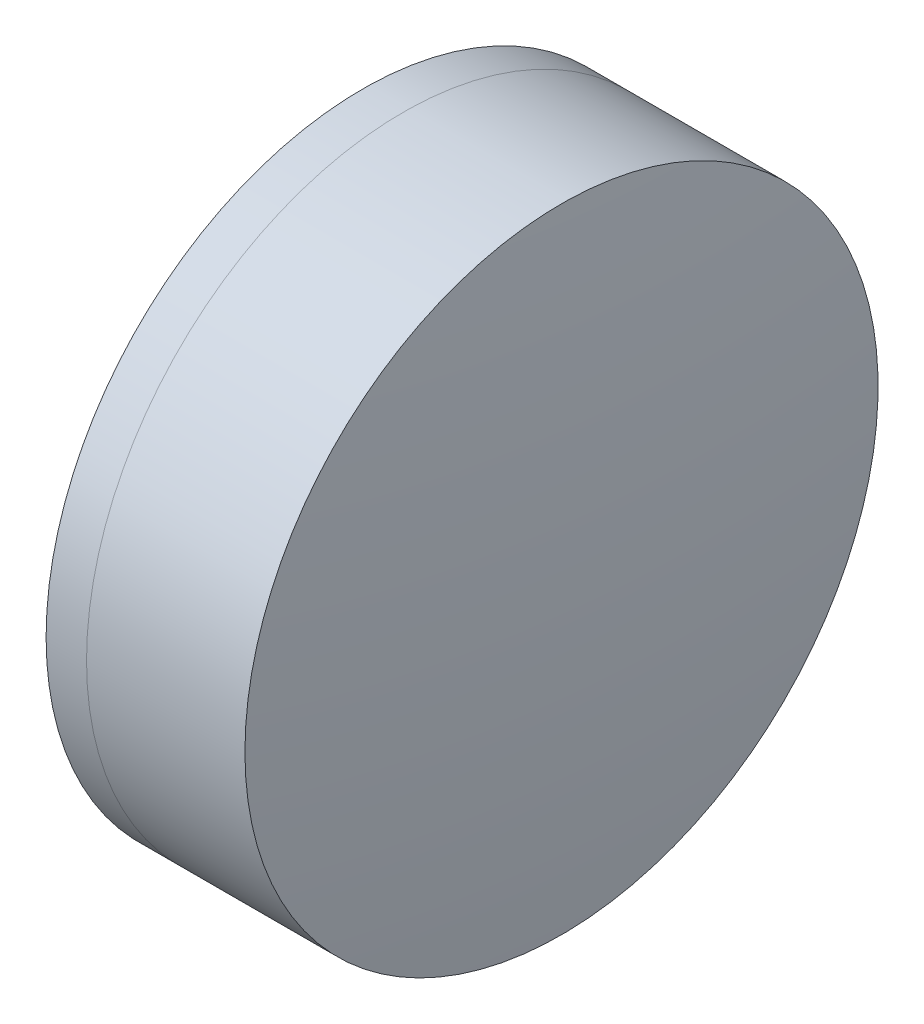
ISO-10303-21;
HEADER;
FILE_DESCRIPTION(('STEP AP214'),'2;1');
FILE_NAME('part.step','',(''),(''),'','','');
FILE_SCHEMA(('AUTOMOTIVE_DESIGN { 1 0 10303 214 1 1 1 1 }'));
ENDSEC;
DATA;
#1=APPLICATION_CONTEXT('core data for automotive mechanical design processes');
#2=APPLICATION_PROTOCOL_DEFINITION('international standard','automotive_design',2000,#1);
#3=PRODUCT_CONTEXT('',#1,'mechanical');
#4=PRODUCT('Part','Part','',(#3));
#5=PRODUCT_RELATED_PRODUCT_CATEGORY('part','',(#4));
#6=PRODUCT_DEFINITION_FORMATION('','',#4);
#7=PRODUCT_DEFINITION_CONTEXT('part definition',#1,'design');
#8=PRODUCT_DEFINITION('design','',#6,#7);
#9=PRODUCT_DEFINITION_SHAPE('','',#8);
#10=(LENGTH_UNIT() NAMED_UNIT(*) SI_UNIT(.MILLI.,.METRE.));
#11=(NAMED_UNIT(*) PLANE_ANGLE_UNIT() SI_UNIT($,.RADIAN.));
#12=(NAMED_UNIT(*) SI_UNIT($,.STERADIAN.) SOLID_ANGLE_UNIT());
#13=UNCERTAINTY_MEASURE_WITH_UNIT(LENGTH_MEASURE(1.E-05),#10,'distance_accuracy_value','');
#14=(GEOMETRIC_REPRESENTATION_CONTEXT(3) GLOBAL_UNCERTAINTY_ASSIGNED_CONTEXT((#13)) GLOBAL_UNIT_ASSIGNED_CONTEXT((#10,
#11,#12)) REPRESENTATION_CONTEXT('',''));
#15=CARTESIAN_POINT('',(0.,0.,0.));
#16=DIRECTION('',(0.,0.,1.));
#17=DIRECTION('',(1.,0.,0.));
#18=AXIS2_PLACEMENT_3D('',#15,#16,#17);
#19=CARTESIAN_POINT('',(-9.12217084702924,0.,0.));
#20=DIRECTION('',(-1.,0.,0.));
#21=DIRECTION('',(0.,0.,1.));
#22=AXIS2_PLACEMENT_3D('',#19,#20,#21);
#23=SPHERICAL_SURFACE('',#22,11.);
#24=CARTESIAN_POINT('',(-0.140105383005944,0.,0.));
#25=DIRECTION('',(-1.,0.,0.));
#26=DIRECTION('',(0.,0.,1.));
#27=AXIS2_PLACEMENT_3D('',#24,#25,#26);
#28=CIRCLE('',#27,6.35);
#29=CARTESIAN_POINT('',(-0.140105383005944,0.,6.35));
#30=VERTEX_POINT('',#29);
#31=EDGE_CURVE('E11',#30,#30,#28,.T.);
#32=ORIENTED_EDGE('',*,*,#31,.T.);
#33=EDGE_LOOP('',(#32));
#34=FACE_BOUND('',#33,.T.);
#35=ADVANCED_FACE('F53',(#34),#23,.F.);
#36=CARTESIAN_POINT('',(-0.551919992657797,0.,0.));
#37=DIRECTION('',(-1.,0.,0.));
#38=DIRECTION('',(0.,0.,1.));
#39=AXIS2_PLACEMENT_3D('',#36,#37,#38);
#40=CYLINDRICAL_SURFACE('',#39,6.35);
#41=CARTESIAN_POINT('',(3.03686153987481,0.,0.));
#42=DIRECTION('',(-1.,0.,0.));
#43=DIRECTION('',(0.,0.,1.));
#44=AXIS2_PLACEMENT_3D('',#41,#42,#43);
#45=CIRCLE('',#44,6.35);
#46=CARTESIAN_POINT('',(3.03686153987481,0.,6.35));
#47=VERTEX_POINT('',#46);
#48=EDGE_CURVE('E60',#47,#47,#45,.T.);
#49=ORIENTED_EDGE('',*,*,#48,.T.);
#50=EDGE_LOOP('',(#49));
#51=FACE_BOUND('',#50,.T.);
#52=ORIENTED_EDGE('',*,*,#31,.F.);
#53=EDGE_LOOP('',(#52));
#54=FACE_BOUND('',#53,.T.);
#55=ADVANCED_FACE('F67',(#51,#54),#40,.T.);
#56=CARTESIAN_POINT('',(-55.9221708470292,0.,0.));
#57=DIRECTION('',(-1.,0.,0.));
#58=DIRECTION('',(0.,0.,1.));
#59=AXIS2_PLACEMENT_3D('',#56,#57,#58);
#60=SPHERICAL_SURFACE('',#59,59.3);
#61=ORIENTED_EDGE('',*,*,#48,.F.);
#62=EDGE_LOOP('',(#61));
#63=FACE_BOUND('',#62,.T.);
#64=ADVANCED_FACE('F70',(#63),#60,.T.);
#65=CLOSED_SHELL('',(#35,#55,#64));
#66=MANIFOLD_SOLID_BREP('B2',#65);
#67=CARTESIAN_POINT('',(10.2778291529708,0.,0.));
#68=DIRECTION('',(-1.,0.,0.));
#69=DIRECTION('',(0.,0.,1.));
#70=AXIS2_PLACEMENT_3D('',#67,#68,#69);
#71=SPHERICAL_SURFACE('',#70,12.9);
#72=CARTESIAN_POINT('',(-0.951039890704117,0.,0.));
#73=DIRECTION('',(-1.,0.,0.));
#74=DIRECTION('',(0.,0.,1.));
#75=AXIS2_PLACEMENT_3D('',#72,#73,#74);
#76=CIRCLE('',#75,6.35);
#77=CARTESIAN_POINT('',(-0.951039890704117,0.,6.35));
#78=VERTEX_POINT('',#77);
#79=EDGE_CURVE('E52',#78,#78,#76,.T.);
#80=ORIENTED_EDGE('',*,*,#79,.T.);
#81=EDGE_LOOP('',(#80));
#82=FACE_BOUND('',#81,.T.);
#83=ADVANCED_FACE('F101',(#82),#71,.T.);
#84=CARTESIAN_POINT('',(-9.70261217833668,0.,0.));
#85=DIRECTION('',(-1.,0.,0.));
#86=DIRECTION('',(0.,0.,1.));
#87=AXIS2_PLACEMENT_3D('',#84,#85,#86);
#88=CYLINDRICAL_SURFACE('',#87,6.35);
#89=CARTESIAN_POINT('',(-0.140105383005944,0.,0.));
#90=DIRECTION('',(-1.,0.,0.));
#91=DIRECTION('',(0.,0.,1.));
#92=AXIS2_PLACEMENT_3D('',#89,#90,#91);
#93=CIRCLE('',#92,6.35);
#94=CARTESIAN_POINT('',(-0.140105383005944,0.,6.35));
#95=VERTEX_POINT('',#94);
#96=EDGE_CURVE('E108',#95,#95,#93,.T.);
#97=ORIENTED_EDGE('',*,*,#96,.T.);
#98=EDGE_LOOP('',(#97));
#99=FACE_BOUND('',#98,.T.);
#100=ORIENTED_EDGE('',*,*,#79,.F.);
#101=EDGE_LOOP('',(#100));
#102=FACE_BOUND('',#101,.T.);
#103=ADVANCED_FACE('F115',(#99,#102),#88,.T.);
#104=CARTESIAN_POINT('',(-9.12217084702924,0.,0.));
#105=DIRECTION('',(-1.,0.,0.));
#106=DIRECTION('',(0.,0.,1.));
#107=AXIS2_PLACEMENT_3D('',#104,#105,#106);
#108=SPHERICAL_SURFACE('',#107,11.);
#109=ORIENTED_EDGE('',*,*,#96,.F.);
#110=EDGE_LOOP('',(#109));
#111=FACE_BOUND('',#110,.T.);
#112=ADVANCED_FACE('F118',(#111),#108,.T.);
#113=CLOSED_SHELL('',(#83,#103,#112));
#114=MANIFOLD_SOLID_BREP('B6',#113);
#115=ADVANCED_BREP_SHAPE_REPRESENTATION('',(#18,#66,#114),#14);
#116=SHAPE_DEFINITION_REPRESENTATION(#9,#115);
ENDSEC;
END-ISO-10303-21;
